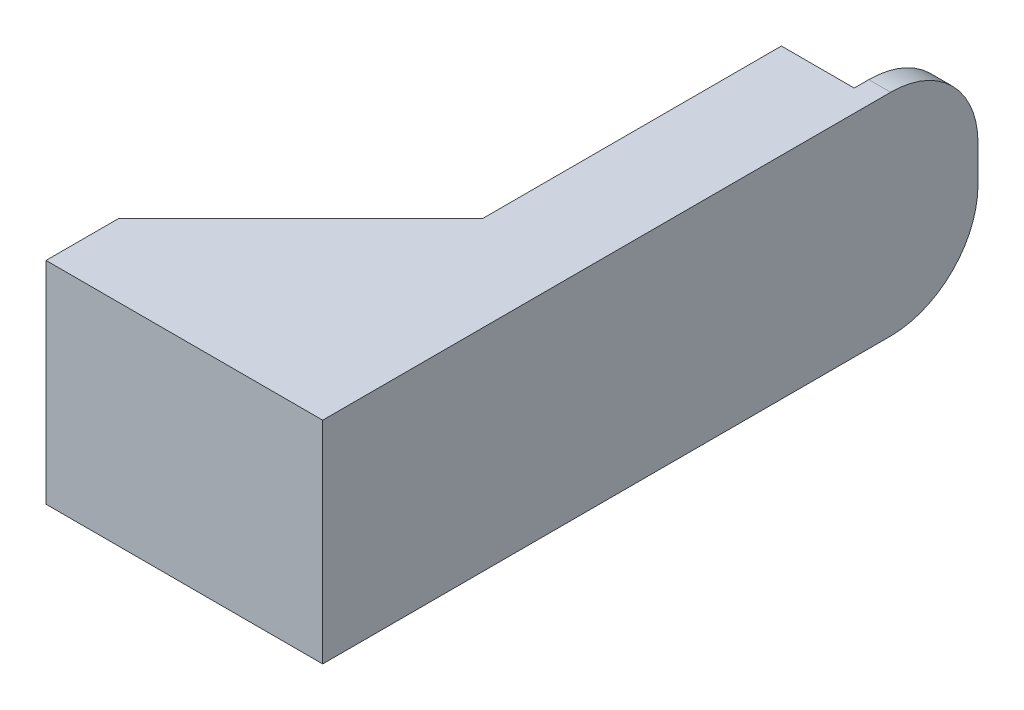
ISO-10303-21;
HEADER;
FILE_DESCRIPTION(('STEP AP214'),'2;1');
FILE_NAME('part.step','',(''),(''),'','','');
FILE_SCHEMA(('AUTOMOTIVE_DESIGN { 1 0 10303 214 1 1 1 1 }'));
ENDSEC;
DATA;
#1=APPLICATION_CONTEXT('core data for automotive mechanical design processes');
#2=APPLICATION_PROTOCOL_DEFINITION('international standard','automotive_design',2000,#1);
#3=PRODUCT_CONTEXT('',#1,'mechanical');
#4=PRODUCT('Part','Part','',(#3));
#5=PRODUCT_RELATED_PRODUCT_CATEGORY('part','',(#4));
#6=PRODUCT_DEFINITION_FORMATION('','',#4);
#7=PRODUCT_DEFINITION_CONTEXT('part definition',#1,'design');
#8=PRODUCT_DEFINITION('design','',#6,#7);
#9=PRODUCT_DEFINITION_SHAPE('','',#8);
#10=(LENGTH_UNIT() NAMED_UNIT(*) SI_UNIT(.MILLI.,.METRE.));
#11=(NAMED_UNIT(*) PLANE_ANGLE_UNIT() SI_UNIT($,.RADIAN.));
#12=(NAMED_UNIT(*) SI_UNIT($,.STERADIAN.) SOLID_ANGLE_UNIT());
#13=UNCERTAINTY_MEASURE_WITH_UNIT(LENGTH_MEASURE(1.E-05),#10,'distance_accuracy_value','');
#14=(GEOMETRIC_REPRESENTATION_CONTEXT(3) GLOBAL_UNCERTAINTY_ASSIGNED_CONTEXT((#13)) GLOBAL_UNIT_ASSIGNED_CONTEXT((#10,
#11,#12)) REPRESENTATION_CONTEXT('',''));
#15=CARTESIAN_POINT('',(0.,0.,0.));
#16=DIRECTION('',(0.,0.,1.));
#17=DIRECTION('',(1.,0.,0.));
#18=AXIS2_PLACEMENT_3D('',#15,#16,#17);
#19=CARTESIAN_POINT('',(0.,-14.5,-50.));
#20=DIRECTION('',(1.,0.,0.));
#21=DIRECTION('',(0.,0.,-1.));
#22=AXIS2_PLACEMENT_3D('',#19,#20,#21);
#23=PLANE('',#22);
#24=DIRECTION('',(0.,-1.,0.));
#25=VECTOR('',#24,1.);
#26=CARTESIAN_POINT('',(0.,-14.5,-90.));
#27=LINE('',#26,#25);
#28=CARTESIAN_POINT('',(0.,2.50000000000001,-90.));
#29=VERTEX_POINT('',#28);
#30=CARTESIAN_POINT('',(0.,-2.50000000000002,-90.));
#31=VERTEX_POINT('',#30);
#32=EDGE_CURVE('E134',#29,#31,#27,.T.);
#33=ORIENTED_EDGE('',*,*,#32,.F.);
#34=CARTESIAN_POINT('',(0.,2.50000000000001,-78.));
#35=DIRECTION('',(1.,0.,0.));
#36=DIRECTION('',(0.,0.,-1.));
#37=AXIS2_PLACEMENT_3D('',#34,#35,#36);
#38=CIRCLE('',#37,12.);
#39=CARTESIAN_POINT('',(0.,14.5,-78.));
#40=VERTEX_POINT('',#39);
#41=EDGE_CURVE('E170',#29,#40,#38,.T.);
#42=ORIENTED_EDGE('',*,*,#41,.T.);
#43=DIRECTION('',(0.,0.,1.));
#44=VECTOR('',#43,1.);
#45=CARTESIAN_POINT('',(0.,14.5,-50.));
#46=LINE('',#45,#44);
#47=CARTESIAN_POINT('',(0.,14.5,0.));
#48=VERTEX_POINT('',#47);
#49=EDGE_CURVE('E149',#40,#48,#46,.T.);
#50=ORIENTED_EDGE('',*,*,#49,.T.);
#51=DIRECTION('',(0.,1.,0.));
#52=VECTOR('',#51,1.);
#53=CARTESIAN_POINT('',(0.,-14.5,0.));
#54=LINE('',#53,#52);
#55=CARTESIAN_POINT('',(0.,-14.5,0.));
#56=VERTEX_POINT('',#55);
#57=EDGE_CURVE('E136',#56,#48,#54,.T.);
#58=ORIENTED_EDGE('',*,*,#57,.F.);
#59=DIRECTION('',(0.,0.,1.));
#60=VECTOR('',#59,1.);
#61=CARTESIAN_POINT('',(0.,-14.5,-50.));
#62=LINE('',#61,#60);
#63=CARTESIAN_POINT('',(0.,-14.5,-78.));
#64=VERTEX_POINT('',#63);
#65=EDGE_CURVE('E157',#64,#56,#62,.T.);
#66=ORIENTED_EDGE('',*,*,#65,.F.);
#67=CARTESIAN_POINT('',(0.,-2.50000000000001,-78.));
#68=DIRECTION('',(1.,0.,0.));
#69=DIRECTION('',(0.,0.,-1.));
#70=AXIS2_PLACEMENT_3D('',#67,#68,#69);
#71=CIRCLE('',#70,12.);
#72=EDGE_CURVE('E167',#64,#31,#71,.T.);
#73=ORIENTED_EDGE('',*,*,#72,.T.);
#74=EDGE_LOOP('',(#33,#42,#50,#58,#66,#73));
#75=FACE_BOUND('',#74,.T.);
#76=ADVANCED_FACE('F33',(#75),#23,.T.);
#77=CARTESIAN_POINT('',(0.,-14.5,-50.));
#78=DIRECTION('',(0.,-1.,0.));
#79=DIRECTION('',(0.,0.,-1.));
#80=AXIS2_PLACEMENT_3D('',#77,#78,#79);
#81=PLANE('',#80);
#82=DIRECTION('',(0.,0.,-1.));
#83=VECTOR('',#82,1.);
#84=CARTESIAN_POINT('',(-3.,-14.5,-76.));
#85=LINE('',#84,#83);
#86=CARTESIAN_POINT('',(-3.,-14.5,-76.));
#87=VERTEX_POINT('',#86);
#88=CARTESIAN_POINT('',(-3.,-14.5,-78.));
#89=VERTEX_POINT('',#88);
#90=EDGE_CURVE('E139',#87,#89,#85,.T.);
#91=ORIENTED_EDGE('',*,*,#90,.T.);
#92=DIRECTION('',(-1.,0.,0.));
#93=VECTOR('',#92,1.);
#94=CARTESIAN_POINT('',(0.,-14.5,-78.));
#95=LINE('',#94,#93);
#96=EDGE_CURVE('E11',#89,#64,#95,.F.);
#97=ORIENTED_EDGE('',*,*,#96,.T.);
#98=ORIENTED_EDGE('',*,*,#65,.T.);
#99=DIRECTION('',(1.,0.,0.));
#100=VECTOR('',#99,1.);
#101=CARTESIAN_POINT('',(0.,-14.5,0.));
#102=LINE('',#101,#100);
#103=CARTESIAN_POINT('',(-38.,-14.5,0.));
#104=VERTEX_POINT('',#103);
#105=EDGE_CURVE('E188',#104,#56,#102,.T.);
#106=ORIENTED_EDGE('',*,*,#105,.F.);
#107=DIRECTION('',(0.,0.,1.));
#108=VECTOR('',#107,1.);
#109=CARTESIAN_POINT('',(-38.,-14.5,-50.));
#110=LINE('',#109,#108);
#111=CARTESIAN_POINT('',(-38.,-14.5,-9.99999999999929));
#112=VERTEX_POINT('',#111);
#113=EDGE_CURVE('E189',#112,#104,#110,.T.);
#114=ORIENTED_EDGE('',*,*,#113,.F.);
#115=DIRECTION('',(0.707106781186544,0.,-0.707106781186551));
#116=VECTOR('',#115,1.);
#117=CARTESIAN_POINT('',(1.00000000000014,-14.5,-48.9999999999999));
#118=LINE('',#117,#116);
#119=CARTESIAN_POINT('',(-13.,-14.5,-34.9999999999996));
#120=VERTEX_POINT('',#119);
#121=EDGE_CURVE('E156',#112,#120,#118,.T.);
#122=ORIENTED_EDGE('',*,*,#121,.T.);
#123=DIRECTION('',(0.,0.,1.));
#124=VECTOR('',#123,1.);
#125=CARTESIAN_POINT('',(-13.,-14.5,-90.));
#126=LINE('',#125,#124);
#127=CARTESIAN_POINT('',(-13.,-14.5,-76.));
#128=VERTEX_POINT('',#127);
#129=EDGE_CURVE('E133',#128,#120,#126,.T.);
#130=ORIENTED_EDGE('',*,*,#129,.F.);
#131=DIRECTION('',(-1.,0.,0.));
#132=VECTOR('',#131,1.);
#133=CARTESIAN_POINT('',(-13.,-14.5,-76.));
#134=LINE('',#133,#132);
#135=EDGE_CURVE('E117',#87,#128,#134,.T.);
#136=ORIENTED_EDGE('',*,*,#135,.F.);
#137=EDGE_LOOP('',(#91,#97,#98,#106,#114,#122,#130,#136));
#138=FACE_BOUND('',#137,.T.);
#139=ADVANCED_FACE('F208',(#138),#81,.T.);
#140=CARTESIAN_POINT('',(-38.,-14.5,-50.));
#141=DIRECTION('',(-1.,0.,0.));
#142=DIRECTION('',(0.,0.,1.));
#143=AXIS2_PLACEMENT_3D('',#140,#141,#142);
#144=PLANE('',#143);
#145=DIRECTION('',(0.,0.,1.));
#146=VECTOR('',#145,1.);
#147=CARTESIAN_POINT('',(-38.,14.5,-50.));
#148=LINE('',#147,#146);
#149=CARTESIAN_POINT('',(-38.,14.5,-9.99999999999929));
#150=VERTEX_POINT('',#149);
#151=CARTESIAN_POINT('',(-38.,14.5,0.));
#152=VERTEX_POINT('',#151);
#153=EDGE_CURVE('E187',#150,#152,#148,.T.);
#154=ORIENTED_EDGE('',*,*,#153,.F.);
#155=DIRECTION('',(0.,-1.,0.));
#156=VECTOR('',#155,1.);
#157=CARTESIAN_POINT('',(-38.,-14.5,-9.9999999999993));
#158=LINE('',#157,#156);
#159=EDGE_CURVE('E153',#150,#112,#158,.T.);
#160=ORIENTED_EDGE('',*,*,#159,.T.);
#161=ORIENTED_EDGE('',*,*,#113,.T.);
#162=DIRECTION('',(0.,-1.,0.));
#163=VECTOR('',#162,1.);
#164=CARTESIAN_POINT('',(-38.,-14.5,0.));
#165=LINE('',#164,#163);
#166=EDGE_CURVE('E191',#152,#104,#165,.T.);
#167=ORIENTED_EDGE('',*,*,#166,.F.);
#168=EDGE_LOOP('',(#154,#160,#161,#167));
#169=FACE_BOUND('',#168,.T.);
#170=ADVANCED_FACE('F204',(#169),#144,.T.);
#171=CARTESIAN_POINT('',(0.,14.5,-50.));
#172=DIRECTION('',(0.,1.,0.));
#173=DIRECTION('',(-1.,0.,0.));
#174=AXIS2_PLACEMENT_3D('',#171,#172,#173);
#175=PLANE('',#174);
#176=ORIENTED_EDGE('',*,*,#49,.F.);
#177=DIRECTION('',(1.,0.,0.));
#178=VECTOR('',#177,1.);
#179=CARTESIAN_POINT('',(-3.,14.5,-78.));
#180=LINE('',#179,#178);
#181=CARTESIAN_POINT('',(-3.,14.5,-78.));
#182=VERTEX_POINT('',#181);
#183=EDGE_CURVE('E56',#40,#182,#180,.F.);
#184=ORIENTED_EDGE('',*,*,#183,.T.);
#185=DIRECTION('',(0.,0.,-1.));
#186=VECTOR('',#185,1.);
#187=CARTESIAN_POINT('',(-3.,14.5,-76.));
#188=LINE('',#187,#186);
#189=CARTESIAN_POINT('',(-3.,14.5,-76.));
#190=VERTEX_POINT('',#189);
#191=EDGE_CURVE('E126',#190,#182,#188,.T.);
#192=ORIENTED_EDGE('',*,*,#191,.F.);
#193=DIRECTION('',(1.,0.,0.));
#194=VECTOR('',#193,1.);
#195=CARTESIAN_POINT('',(-13.,14.5,-76.));
#196=LINE('',#195,#194);
#197=CARTESIAN_POINT('',(-13.,14.5,-76.));
#198=VERTEX_POINT('',#197);
#199=EDGE_CURVE('E115',#198,#190,#196,.T.);
#200=ORIENTED_EDGE('',*,*,#199,.F.);
#201=DIRECTION('',(0.,0.,1.));
#202=VECTOR('',#201,1.);
#203=CARTESIAN_POINT('',(-13.,14.5,-90.));
#204=LINE('',#203,#202);
#205=CARTESIAN_POINT('',(-13.,14.5,-34.9999999999996));
#206=VERTEX_POINT('',#205);
#207=EDGE_CURVE('E124',#198,#206,#204,.T.);
#208=ORIENTED_EDGE('',*,*,#207,.T.);
#209=DIRECTION('',(-0.707106781186544,0.,0.707106781186551));
#210=VECTOR('',#209,1.);
#211=CARTESIAN_POINT('',(1.00000000000014,14.5,-48.9999999999999));
#212=LINE('',#211,#210);
#213=EDGE_CURVE('E160',#206,#150,#212,.T.);
#214=ORIENTED_EDGE('',*,*,#213,.T.);
#215=ORIENTED_EDGE('',*,*,#153,.T.);
#216=DIRECTION('',(-1.,0.,0.));
#217=VECTOR('',#216,1.);
#218=CARTESIAN_POINT('',(0.,14.5,0.));
#219=LINE('',#218,#217);
#220=EDGE_CURVE('E185',#48,#152,#219,.T.);
#221=ORIENTED_EDGE('',*,*,#220,.F.);
#222=EDGE_LOOP('',(#176,#184,#192,#200,#208,#214,#215,#221));
#223=FACE_BOUND('',#222,.T.);
#224=ADVANCED_FACE('F123',(#223),#175,.T.);
#225=CARTESIAN_POINT('',(0.,0.,0.));
#226=DIRECTION('',(0.,0.,1.));
#227=DIRECTION('',(1.,0.,0.));
#228=AXIS2_PLACEMENT_3D('',#225,#226,#227);
#229=PLANE('',#228);
#230=ORIENTED_EDGE('',*,*,#57,.T.);
#231=ORIENTED_EDGE('',*,*,#220,.T.);
#232=ORIENTED_EDGE('',*,*,#166,.T.);
#233=ORIENTED_EDGE('',*,*,#105,.T.);
#234=EDGE_LOOP('',(#230,#231,#232,#233));
#235=FACE_BOUND('',#234,.T.);
#236=ADVANCED_FACE('F207',(#235),#229,.T.);
#237=CARTESIAN_POINT('',(-13.,-14.5,-90.));
#238=DIRECTION('',(1.,0.,0.));
#239=DIRECTION('',(0.,0.,-1.));
#240=AXIS2_PLACEMENT_3D('',#237,#238,#239);
#241=PLANE('',#240);
#242=ORIENTED_EDGE('',*,*,#207,.F.);
#243=DIRECTION('',(0.,1.,0.));
#244=VECTOR('',#243,1.);
#245=CARTESIAN_POINT('',(-13.,14.5,-76.));
#246=LINE('',#245,#244);
#247=EDGE_CURVE('E111',#128,#198,#246,.T.);
#248=ORIENTED_EDGE('',*,*,#247,.F.);
#249=ORIENTED_EDGE('',*,*,#129,.T.);
#250=DIRECTION('',(0.,1.,0.));
#251=VECTOR('',#250,1.);
#252=CARTESIAN_POINT('',(-13.,-14.5,-34.9999999999996));
#253=LINE('',#252,#251);
#254=EDGE_CURVE('E131',#120,#206,#253,.T.);
#255=ORIENTED_EDGE('',*,*,#254,.T.);
#256=EDGE_LOOP('',(#242,#248,#249,#255));
#257=FACE_BOUND('',#256,.T.);
#258=ADVANCED_FACE('F129',(#257),#241,.F.);
#259=CARTESIAN_POINT('',(0.,0.,-90.));
#260=DIRECTION('',(0.,0.,1.));
#261=DIRECTION('',(1.,0.,0.));
#262=AXIS2_PLACEMENT_3D('',#259,#260,#261);
#263=PLANE('',#262);
#264=DIRECTION('',(0.,-1.,0.));
#265=VECTOR('',#264,1.);
#266=CARTESIAN_POINT('',(-3.,14.5,-90.));
#267=LINE('',#266,#265);
#268=CARTESIAN_POINT('',(-3.,2.50000000000001,-90.));
#269=VERTEX_POINT('',#268);
#270=CARTESIAN_POINT('',(-3.,-2.50000000000001,-90.));
#271=VERTEX_POINT('',#270);
#272=EDGE_CURVE('E121',#269,#271,#267,.T.);
#273=ORIENTED_EDGE('',*,*,#272,.F.);
#274=DIRECTION('',(1.,0.,0.));
#275=VECTOR('',#274,1.);
#276=CARTESIAN_POINT('',(0.,2.50000000000001,-90.));
#277=LINE('',#276,#275);
#278=EDGE_CURVE('E162',#269,#29,#277,.T.);
#279=ORIENTED_EDGE('',*,*,#278,.T.);
#280=ORIENTED_EDGE('',*,*,#32,.T.);
#281=DIRECTION('',(-1.,0.,0.));
#282=VECTOR('',#281,1.);
#283=CARTESIAN_POINT('',(-3.,-2.50000000000001,-90.));
#284=LINE('',#283,#282);
#285=EDGE_CURVE('E145',#31,#271,#284,.T.);
#286=ORIENTED_EDGE('',*,*,#285,.T.);
#287=EDGE_LOOP('',(#273,#279,#280,#286));
#288=FACE_BOUND('',#287,.T.);
#289=ADVANCED_FACE('F178',(#288),#263,.F.);
#290=CARTESIAN_POINT('',(-38.,-14.5,-9.9999999999993));
#291=DIRECTION('',(-0.707106781186551,0.,-0.707106781186544));
#292=DIRECTION('',(0.,1.,0.));
#293=AXIS2_PLACEMENT_3D('',#290,#291,#292);
#294=PLANE('',#293);
#295=ORIENTED_EDGE('',*,*,#213,.F.);
#296=ORIENTED_EDGE('',*,*,#254,.F.);
#297=ORIENTED_EDGE('',*,*,#121,.F.);
#298=ORIENTED_EDGE('',*,*,#159,.F.);
#299=EDGE_LOOP('',(#295,#296,#297,#298));
#300=FACE_BOUND('',#299,.T.);
#301=ADVANCED_FACE('F218',(#300),#294,.T.);
#302=CARTESIAN_POINT('',(-3.,14.5,-76.));
#303=DIRECTION('',(1.,0.,0.));
#304=DIRECTION('',(0.,1.,0.));
#305=AXIS2_PLACEMENT_3D('',#302,#303,#304);
#306=PLANE('',#305);
#307=ORIENTED_EDGE('',*,*,#191,.T.);
#308=CARTESIAN_POINT('',(-3.,2.50000000000001,-78.));
#309=DIRECTION('',(1.,0.,0.));
#310=DIRECTION('',(0.,1.,0.));
#311=AXIS2_PLACEMENT_3D('',#308,#309,#310);
#312=CIRCLE('',#311,12.);
#313=EDGE_CURVE('E41',#182,#269,#312,.F.);
#314=ORIENTED_EDGE('',*,*,#313,.T.);
#315=ORIENTED_EDGE('',*,*,#272,.T.);
#316=CARTESIAN_POINT('',(-3.,-2.50000000000001,-78.));
#317=DIRECTION('',(1.,0.,0.));
#318=DIRECTION('',(0.,1.,0.));
#319=AXIS2_PLACEMENT_3D('',#316,#317,#318);
#320=CIRCLE('',#319,12.);
#321=EDGE_CURVE('E48',#271,#89,#320,.F.);
#322=ORIENTED_EDGE('',*,*,#321,.T.);
#323=ORIENTED_EDGE('',*,*,#90,.F.);
#324=DIRECTION('',(0.,-1.,0.));
#325=VECTOR('',#324,1.);
#326=CARTESIAN_POINT('',(-3.,14.5,-76.));
#327=LINE('',#326,#325);
#328=EDGE_CURVE('E127',#190,#87,#327,.T.);
#329=ORIENTED_EDGE('',*,*,#328,.F.);
#330=EDGE_LOOP('',(#307,#314,#315,#322,#323,#329));
#331=FACE_BOUND('',#330,.T.);
#332=ADVANCED_FACE('F176',(#331),#306,.F.);
#333=CARTESIAN_POINT('',(0.,0.,-76.));
#334=DIRECTION('',(0.,0.,1.));
#335=DIRECTION('',(1.,0.,0.));
#336=AXIS2_PLACEMENT_3D('',#333,#334,#335);
#337=PLANE('',#336);
#338=ORIENTED_EDGE('',*,*,#247,.T.);
#339=ORIENTED_EDGE('',*,*,#199,.T.);
#340=ORIENTED_EDGE('',*,*,#328,.T.);
#341=ORIENTED_EDGE('',*,*,#135,.T.);
#342=EDGE_LOOP('',(#338,#339,#340,#341));
#343=FACE_BOUND('',#342,.T.);
#344=ADVANCED_FACE('F113',(#343),#337,.F.);
#345=CARTESIAN_POINT('',(0.,2.50000000000001,-78.));
#346=DIRECTION('',(-1.,0.,0.));
#347=DIRECTION('',(0.,-1.,0.));
#348=AXIS2_PLACEMENT_3D('',#345,#346,#347);
#349=CYLINDRICAL_SURFACE('',#348,12.);
#350=ORIENTED_EDGE('',*,*,#313,.F.);
#351=ORIENTED_EDGE('',*,*,#183,.F.);
#352=ORIENTED_EDGE('',*,*,#41,.F.);
#353=ORIENTED_EDGE('',*,*,#278,.F.);
#354=EDGE_LOOP('',(#350,#351,#352,#353));
#355=FACE_BOUND('',#354,.T.);
#356=ADVANCED_FACE('F180',(#355),#349,.T.);
#357=CARTESIAN_POINT('',(0.,-2.50000000000001,-78.));
#358=DIRECTION('',(1.,0.,0.));
#359=DIRECTION('',(0.,0.,-1.));
#360=AXIS2_PLACEMENT_3D('',#357,#358,#359);
#361=CYLINDRICAL_SURFACE('',#360,12.);
#362=ORIENTED_EDGE('',*,*,#72,.F.);
#363=ORIENTED_EDGE('',*,*,#96,.F.);
#364=ORIENTED_EDGE('',*,*,#321,.F.);
#365=ORIENTED_EDGE('',*,*,#285,.F.);
#366=EDGE_LOOP('',(#362,#363,#364,#365));
#367=FACE_BOUND('',#366,.T.);
#368=ADVANCED_FACE('F35',(#367),#361,.T.);
#369=CLOSED_SHELL('',(#76,#139,#170,#224,#236,#258,#289,#301,#332,#344,#356,#368));
#370=MANIFOLD_SOLID_BREP('B2',#369);
#371=ADVANCED_BREP_SHAPE_REPRESENTATION('',(#18,#370),#14);
#372=SHAPE_DEFINITION_REPRESENTATION(#9,#371);
ENDSEC;
END-ISO-10303-21;
